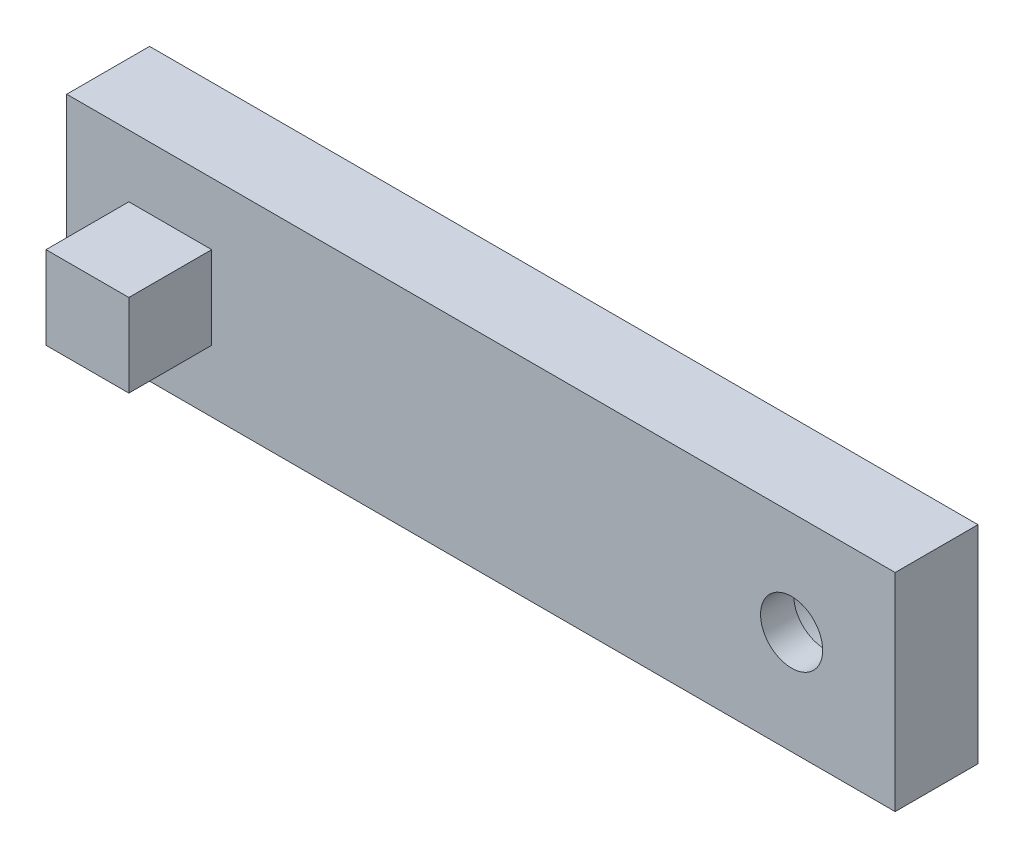
ISO-10303-21;
HEADER;
FILE_DESCRIPTION(('STEP AP214'),'2;1');
FILE_NAME('part.step','',(''),(''),'','','');
FILE_SCHEMA(('AUTOMOTIVE_DESIGN { 1 0 10303 214 1 1 1 1 }'));
ENDSEC;
DATA;
#1=APPLICATION_CONTEXT('core data for automotive mechanical design processes');
#2=APPLICATION_PROTOCOL_DEFINITION('international standard','automotive_design',2000,#1);
#3=PRODUCT_CONTEXT('',#1,'mechanical');
#4=PRODUCT('Part','Part','',(#3));
#5=PRODUCT_RELATED_PRODUCT_CATEGORY('part','',(#4));
#6=PRODUCT_DEFINITION_FORMATION('','',#4);
#7=PRODUCT_DEFINITION_CONTEXT('part definition',#1,'design');
#8=PRODUCT_DEFINITION('design','',#6,#7);
#9=PRODUCT_DEFINITION_SHAPE('','',#8);
#10=(LENGTH_UNIT() NAMED_UNIT(*) SI_UNIT(.MILLI.,.METRE.));
#11=(NAMED_UNIT(*) PLANE_ANGLE_UNIT() SI_UNIT($,.RADIAN.));
#12=(NAMED_UNIT(*) SI_UNIT($,.STERADIAN.) SOLID_ANGLE_UNIT());
#13=UNCERTAINTY_MEASURE_WITH_UNIT(LENGTH_MEASURE(1.E-05),#10,'distance_accuracy_value','');
#14=(GEOMETRIC_REPRESENTATION_CONTEXT(3) GLOBAL_UNCERTAINTY_ASSIGNED_CONTEXT((#13)) GLOBAL_UNIT_ASSIGNED_CONTEXT((#10,
#11,#12)) REPRESENTATION_CONTEXT('',''));
#15=CARTESIAN_POINT('',(0.,0.,0.));
#16=DIRECTION('',(0.,0.,1.));
#17=DIRECTION('',(1.,0.,0.));
#18=AXIS2_PLACEMENT_3D('',#15,#16,#17);
#19=CARTESIAN_POINT('',(75.,0.,0.));
#20=DIRECTION('',(0.,0.,1.));
#21=DIRECTION('',(1.,0.,0.));
#22=AXIS2_PLACEMENT_3D('',#19,#20,#21);
#23=CYLINDRICAL_SURFACE('',#22,7.50000000000001);
#24=CARTESIAN_POINT('',(75.,0.,20.));
#25=DIRECTION('',(0.,0.,1.));
#26=DIRECTION('',(1.,0.,0.));
#27=AXIS2_PLACEMENT_3D('',#24,#25,#26);
#28=CIRCLE('',#27,7.50000000000001);
#29=CARTESIAN_POINT('',(82.5,0.,20.));
#30=VERTEX_POINT('',#29);
#31=EDGE_CURVE('E304',#30,#30,#28,.T.);
#32=ORIENTED_EDGE('',*,*,#31,.T.);
#33=EDGE_LOOP('',(#32));
#34=FACE_BOUND('',#33,.T.);
#35=CARTESIAN_POINT('',(75.,0.,12.));
#36=DIRECTION('',(0.,0.,-1.));
#37=DIRECTION('',(-1.,0.,0.));
#38=AXIS2_PLACEMENT_3D('',#35,#36,#37);
#39=CIRCLE('',#38,7.50000000000001);
#40=CARTESIAN_POINT('',(67.5,0.,12.));
#41=VERTEX_POINT('',#40);
#42=EDGE_CURVE('E37',#41,#41,#39,.F.);
#43=ORIENTED_EDGE('',*,*,#42,.F.);
#44=EDGE_LOOP('',(#43));
#45=FACE_BOUND('',#44,.T.);
#46=ADVANCED_FACE('F33',(#34,#45),#23,.F.);
#47=CARTESIAN_POINT('',(0.,0.,20.));
#48=DIRECTION('',(0.,0.,-1.));
#49=DIRECTION('',(-1.,0.,0.));
#50=AXIS2_PLACEMENT_3D('',#47,#48,#49);
#51=PLANE('',#50);
#52=ORIENTED_EDGE('',*,*,#31,.F.);
#53=EDGE_LOOP('',(#52));
#54=FACE_BOUND('',#53,.T.);
#55=DIRECTION('',(0.,-1.,0.));
#56=VECTOR('',#55,1.);
#57=CARTESIAN_POINT('',(-100.,25.,20.));
#58=LINE('',#57,#56);
#59=CARTESIAN_POINT('',(-100.,25.,20.));
#60=VERTEX_POINT('',#59);
#61=CARTESIAN_POINT('',(-100.,-25.,20.));
#62=VERTEX_POINT('',#61);
#63=EDGE_CURVE('E129',#60,#62,#58,.T.);
#64=ORIENTED_EDGE('',*,*,#63,.T.);
#65=DIRECTION('',(1.,0.,0.));
#66=VECTOR('',#65,1.);
#67=CARTESIAN_POINT('',(100.,-25.,20.));
#68=LINE('',#67,#66);
#69=CARTESIAN_POINT('',(100.,-25.,20.));
#70=VERTEX_POINT('',#69);
#71=EDGE_CURVE('E132',#62,#70,#68,.T.);
#72=ORIENTED_EDGE('',*,*,#71,.T.);
#73=DIRECTION('',(0.,1.,0.));
#74=VECTOR('',#73,1.);
#75=CARTESIAN_POINT('',(100.,25.,20.));
#76=LINE('',#75,#74);
#77=CARTESIAN_POINT('',(100.,25.,20.));
#78=VERTEX_POINT('',#77);
#79=EDGE_CURVE('E135',#70,#78,#76,.T.);
#80=ORIENTED_EDGE('',*,*,#79,.T.);
#81=DIRECTION('',(-1.,0.,0.));
#82=VECTOR('',#81,1.);
#83=CARTESIAN_POINT('',(100.,25.,20.));
#84=LINE('',#83,#82);
#85=EDGE_CURVE('E137',#78,#60,#84,.T.);
#86=ORIENTED_EDGE('',*,*,#85,.T.);
#87=EDGE_LOOP('',(#64,#72,#80,#86));
#88=FACE_BOUND('',#87,.T.);
#89=DIRECTION('',(0.,-1.,0.));
#90=VECTOR('',#89,1.);
#91=CARTESIAN_POINT('',(-85.,9.99999999999998,20.));
#92=LINE('',#91,#90);
#93=CARTESIAN_POINT('',(-85.,9.99999999999998,20.));
#94=VERTEX_POINT('',#93);
#95=CARTESIAN_POINT('',(-85.,-10.,20.));
#96=VERTEX_POINT('',#95);
#97=EDGE_CURVE('E119',#94,#96,#92,.T.);
#98=ORIENTED_EDGE('',*,*,#97,.F.);
#99=DIRECTION('',(-1.,0.,0.));
#100=VECTOR('',#99,1.);
#101=CARTESIAN_POINT('',(-65.,9.99999999999999,20.));
#102=LINE('',#101,#100);
#103=CARTESIAN_POINT('',(-65.,9.99999999999999,20.));
#104=VERTEX_POINT('',#103);
#105=EDGE_CURVE('E116',#104,#94,#102,.T.);
#106=ORIENTED_EDGE('',*,*,#105,.F.);
#107=DIRECTION('',(0.,1.,0.));
#108=VECTOR('',#107,1.);
#109=CARTESIAN_POINT('',(-65.,9.99999999999999,20.));
#110=LINE('',#109,#108);
#111=CARTESIAN_POINT('',(-65.,-10.,20.));
#112=VERTEX_POINT('',#111);
#113=EDGE_CURVE('E54',#112,#104,#110,.T.);
#114=ORIENTED_EDGE('',*,*,#113,.F.);
#115=DIRECTION('',(1.,0.,0.));
#116=VECTOR('',#115,1.);
#117=CARTESIAN_POINT('',(-65.,-10.,20.));
#118=LINE('',#117,#116);
#119=EDGE_CURVE('E49',#96,#112,#118,.T.);
#120=ORIENTED_EDGE('',*,*,#119,.F.);
#121=EDGE_LOOP('',(#98,#106,#114,#120));
#122=FACE_BOUND('',#121,.T.);
#123=ADVANCED_FACE('F169',(#54,#88,#122),#51,.F.);
#124=CARTESIAN_POINT('',(-100.,25.,20.));
#125=DIRECTION('',(1.,0.,0.));
#126=DIRECTION('',(0.,0.,-1.));
#127=AXIS2_PLACEMENT_3D('',#124,#125,#126);
#128=PLANE('',#127);
#129=DIRECTION('',(0.,-1.,0.));
#130=VECTOR('',#129,1.);
#131=CARTESIAN_POINT('',(-100.,25.,0.));
#132=LINE('',#131,#130);
#133=CARTESIAN_POINT('',(-100.,25.,0.));
#134=VERTEX_POINT('',#133);
#135=CARTESIAN_POINT('',(-100.,-25.,0.));
#136=VERTEX_POINT('',#135);
#137=EDGE_CURVE('E120',#134,#136,#132,.T.);
#138=ORIENTED_EDGE('',*,*,#137,.T.);
#139=DIRECTION('',(0.,0.,-1.));
#140=VECTOR('',#139,1.);
#141=CARTESIAN_POINT('',(-100.,-25.,20.));
#142=LINE('',#141,#140);
#143=EDGE_CURVE('E11',#62,#136,#142,.T.);
#144=ORIENTED_EDGE('',*,*,#143,.F.);
#145=ORIENTED_EDGE('',*,*,#63,.F.);
#146=DIRECTION('',(0.,0.,-1.));
#147=VECTOR('',#146,1.);
#148=CARTESIAN_POINT('',(-100.,25.,20.));
#149=LINE('',#148,#147);
#150=EDGE_CURVE('E138',#60,#134,#149,.T.);
#151=ORIENTED_EDGE('',*,*,#150,.T.);
#152=EDGE_LOOP('',(#138,#144,#145,#151));
#153=FACE_BOUND('',#152,.T.);
#154=ADVANCED_FACE('F35',(#153),#128,.F.);
#155=CARTESIAN_POINT('',(100.,-25.,20.));
#156=DIRECTION('',(0.,1.,0.));
#157=DIRECTION('',(-1.,0.,0.));
#158=AXIS2_PLACEMENT_3D('',#155,#156,#157);
#159=PLANE('',#158);
#160=DIRECTION('',(1.,0.,0.));
#161=VECTOR('',#160,1.);
#162=CARTESIAN_POINT('',(100.,-25.,0.));
#163=LINE('',#162,#161);
#164=CARTESIAN_POINT('',(100.,-25.,0.));
#165=VERTEX_POINT('',#164);
#166=EDGE_CURVE('E123',#136,#165,#163,.T.);
#167=ORIENTED_EDGE('',*,*,#166,.T.);
#168=DIRECTION('',(0.,0.,-1.));
#169=VECTOR('',#168,1.);
#170=CARTESIAN_POINT('',(100.,-25.,20.));
#171=LINE('',#170,#169);
#172=EDGE_CURVE('E42',#70,#165,#171,.T.);
#173=ORIENTED_EDGE('',*,*,#172,.F.);
#174=ORIENTED_EDGE('',*,*,#71,.F.);
#175=ORIENTED_EDGE('',*,*,#143,.T.);
#176=EDGE_LOOP('',(#167,#173,#174,#175));
#177=FACE_BOUND('',#176,.T.);
#178=ADVANCED_FACE('F170',(#177),#159,.F.);
#179=CARTESIAN_POINT('',(100.,25.,20.));
#180=DIRECTION('',(-1.,0.,0.));
#181=DIRECTION('',(0.,-1.,0.));
#182=AXIS2_PLACEMENT_3D('',#179,#180,#181);
#183=PLANE('',#182);
#184=DIRECTION('',(0.,1.,0.));
#185=VECTOR('',#184,1.);
#186=CARTESIAN_POINT('',(100.,25.,0.));
#187=LINE('',#186,#185);
#188=CARTESIAN_POINT('',(100.,25.,0.));
#189=VERTEX_POINT('',#188);
#190=EDGE_CURVE('E141',#165,#189,#187,.T.);
#191=ORIENTED_EDGE('',*,*,#190,.T.);
#192=DIRECTION('',(0.,0.,-1.));
#193=VECTOR('',#192,1.);
#194=CARTESIAN_POINT('',(100.,25.,20.));
#195=LINE('',#194,#193);
#196=EDGE_CURVE('E146',#78,#189,#195,.T.);
#197=ORIENTED_EDGE('',*,*,#196,.F.);
#198=ORIENTED_EDGE('',*,*,#79,.F.);
#199=ORIENTED_EDGE('',*,*,#172,.T.);
#200=EDGE_LOOP('',(#191,#197,#198,#199));
#201=FACE_BOUND('',#200,.T.);
#202=ADVANCED_FACE('F154',(#201),#183,.F.);
#203=CARTESIAN_POINT('',(100.,25.,20.));
#204=DIRECTION('',(0.,-1.,0.));
#205=DIRECTION('',(1.,0.,0.));
#206=AXIS2_PLACEMENT_3D('',#203,#204,#205);
#207=PLANE('',#206);
#208=DIRECTION('',(-1.,0.,0.));
#209=VECTOR('',#208,1.);
#210=CARTESIAN_POINT('',(100.,25.,0.));
#211=LINE('',#210,#209);
#212=EDGE_CURVE('E133',#189,#134,#211,.T.);
#213=ORIENTED_EDGE('',*,*,#212,.T.);
#214=ORIENTED_EDGE('',*,*,#150,.F.);
#215=ORIENTED_EDGE('',*,*,#85,.F.);
#216=ORIENTED_EDGE('',*,*,#196,.T.);
#217=EDGE_LOOP('',(#213,#214,#215,#216));
#218=FACE_BOUND('',#217,.T.);
#219=ADVANCED_FACE('F163',(#218),#207,.F.);
#220=CARTESIAN_POINT('',(0.,0.,0.));
#221=DIRECTION('',(0.,0.,-1.));
#222=DIRECTION('',(-1.,0.,0.));
#223=AXIS2_PLACEMENT_3D('',#220,#221,#222);
#224=PLANE('',#223);
#225=CARTESIAN_POINT('',(75.,0.,0.));
#226=DIRECTION('',(0.,0.,-1.));
#227=DIRECTION('',(-1.,0.,0.));
#228=AXIS2_PLACEMENT_3D('',#225,#226,#227);
#229=CIRCLE('',#228,16.25);
#230=CARTESIAN_POINT('',(58.75,0.,0.));
#231=VERTEX_POINT('',#230);
#232=EDGE_CURVE('E300',#231,#231,#229,.T.);
#233=ORIENTED_EDGE('',*,*,#232,.F.);
#234=EDGE_LOOP('',(#233));
#235=FACE_BOUND('',#234,.T.);
#236=ORIENTED_EDGE('',*,*,#137,.F.);
#237=ORIENTED_EDGE('',*,*,#212,.F.);
#238=ORIENTED_EDGE('',*,*,#190,.F.);
#239=ORIENTED_EDGE('',*,*,#166,.F.);
#240=EDGE_LOOP('',(#236,#237,#238,#239));
#241=FACE_BOUND('',#240,.T.);
#242=ADVANCED_FACE('F160',(#235,#241),#224,.T.);
#243=CARTESIAN_POINT('',(-85.,9.99999999999998,40.));
#244=DIRECTION('',(1.,0.,0.));
#245=DIRECTION('',(0.,0.,-1.));
#246=AXIS2_PLACEMENT_3D('',#243,#244,#245);
#247=PLANE('',#246);
#248=ORIENTED_EDGE('',*,*,#97,.T.);
#249=DIRECTION('',(0.,0.,-1.));
#250=VECTOR('',#249,1.);
#251=CARTESIAN_POINT('',(-85.,-10.,40.));
#252=LINE('',#251,#250);
#253=CARTESIAN_POINT('',(-85.,-10.,40.));
#254=VERTEX_POINT('',#253);
#255=EDGE_CURVE('E100',#254,#96,#252,.T.);
#256=ORIENTED_EDGE('',*,*,#255,.F.);
#257=DIRECTION('',(0.,-1.,0.));
#258=VECTOR('',#257,1.);
#259=CARTESIAN_POINT('',(-85.,9.99999999999998,40.));
#260=LINE('',#259,#258);
#261=CARTESIAN_POINT('',(-85.,9.99999999999998,40.));
#262=VERTEX_POINT('',#261);
#263=EDGE_CURVE('E107',#262,#254,#260,.T.);
#264=ORIENTED_EDGE('',*,*,#263,.F.);
#265=DIRECTION('',(0.,0.,-1.));
#266=VECTOR('',#265,1.);
#267=CARTESIAN_POINT('',(-85.,9.99999999999998,40.));
#268=LINE('',#267,#266);
#269=EDGE_CURVE('E308',#262,#94,#268,.T.);
#270=ORIENTED_EDGE('',*,*,#269,.T.);
#271=EDGE_LOOP('',(#248,#256,#264,#270));
#272=FACE_BOUND('',#271,.T.);
#273=ADVANCED_FACE('F118',(#272),#247,.F.);
#274=CARTESIAN_POINT('',(-65.,-10.,40.));
#275=DIRECTION('',(0.,1.,0.));
#276=DIRECTION('',(-1.,0.,0.));
#277=AXIS2_PLACEMENT_3D('',#274,#275,#276);
#278=PLANE('',#277);
#279=ORIENTED_EDGE('',*,*,#119,.T.);
#280=DIRECTION('',(0.,0.,-1.));
#281=VECTOR('',#280,1.);
#282=CARTESIAN_POINT('',(-65.,-10.,40.));
#283=LINE('',#282,#281);
#284=CARTESIAN_POINT('',(-65.,-10.,40.));
#285=VERTEX_POINT('',#284);
#286=EDGE_CURVE('E103',#285,#112,#283,.T.);
#287=ORIENTED_EDGE('',*,*,#286,.F.);
#288=DIRECTION('',(1.,0.,0.));
#289=VECTOR('',#288,1.);
#290=CARTESIAN_POINT('',(-65.,-10.,40.));
#291=LINE('',#290,#289);
#292=EDGE_CURVE('E96',#254,#285,#291,.T.);
#293=ORIENTED_EDGE('',*,*,#292,.F.);
#294=ORIENTED_EDGE('',*,*,#255,.T.);
#295=EDGE_LOOP('',(#279,#287,#293,#294));
#296=FACE_BOUND('',#295,.T.);
#297=ADVANCED_FACE('F98',(#296),#278,.F.);
#298=CARTESIAN_POINT('',(-65.,9.99999999999999,40.));
#299=DIRECTION('',(-1.,0.,0.));
#300=DIRECTION('',(0.,0.,1.));
#301=AXIS2_PLACEMENT_3D('',#298,#299,#300);
#302=PLANE('',#301);
#303=ORIENTED_EDGE('',*,*,#113,.T.);
#304=DIRECTION('',(0.,0.,-1.));
#305=VECTOR('',#304,1.);
#306=CARTESIAN_POINT('',(-65.,9.99999999999999,40.));
#307=LINE('',#306,#305);
#308=CARTESIAN_POINT('',(-65.,9.99999999999999,40.));
#309=VERTEX_POINT('',#308);
#310=EDGE_CURVE('E125',#309,#104,#307,.T.);
#311=ORIENTED_EDGE('',*,*,#310,.F.);
#312=DIRECTION('',(0.,1.,0.));
#313=VECTOR('',#312,1.);
#314=CARTESIAN_POINT('',(-65.,9.99999999999999,40.));
#315=LINE('',#314,#313);
#316=EDGE_CURVE('E106',#285,#309,#315,.T.);
#317=ORIENTED_EDGE('',*,*,#316,.F.);
#318=ORIENTED_EDGE('',*,*,#286,.T.);
#319=EDGE_LOOP('',(#303,#311,#317,#318));
#320=FACE_BOUND('',#319,.T.);
#321=ADVANCED_FACE('F197',(#320),#302,.F.);
#322=CARTESIAN_POINT('',(-65.,9.99999999999999,40.));
#323=DIRECTION('',(0.,-1.,0.));
#324=DIRECTION('',(1.,0.,0.));
#325=AXIS2_PLACEMENT_3D('',#322,#323,#324);
#326=PLANE('',#325);
#327=ORIENTED_EDGE('',*,*,#105,.T.);
#328=ORIENTED_EDGE('',*,*,#269,.F.);
#329=DIRECTION('',(-1.,0.,0.));
#330=VECTOR('',#329,1.);
#331=CARTESIAN_POINT('',(-65.,9.99999999999999,40.));
#332=LINE('',#331,#330);
#333=EDGE_CURVE('E112',#309,#262,#332,.T.);
#334=ORIENTED_EDGE('',*,*,#333,.F.);
#335=ORIENTED_EDGE('',*,*,#310,.T.);
#336=EDGE_LOOP('',(#327,#328,#334,#335));
#337=FACE_BOUND('',#336,.T.);
#338=ADVANCED_FACE('F194',(#337),#326,.F.);
#339=CARTESIAN_POINT('',(0.,0.,40.));
#340=DIRECTION('',(0.,0.,-1.));
#341=DIRECTION('',(-1.,0.,0.));
#342=AXIS2_PLACEMENT_3D('',#339,#340,#341);
#343=PLANE('',#342);
#344=ORIENTED_EDGE('',*,*,#263,.T.);
#345=ORIENTED_EDGE('',*,*,#292,.T.);
#346=ORIENTED_EDGE('',*,*,#316,.T.);
#347=ORIENTED_EDGE('',*,*,#333,.T.);
#348=EDGE_LOOP('',(#344,#345,#346,#347));
#349=FACE_BOUND('',#348,.T.);
#350=ADVANCED_FACE('F110',(#349),#343,.F.);
#351=CARTESIAN_POINT('',(75.,0.,12.));
#352=DIRECTION('',(0.,0.,-1.));
#353=DIRECTION('',(-1.,0.,0.));
#354=AXIS2_PLACEMENT_3D('',#351,#352,#353);
#355=PLANE('',#354);
#356=CARTESIAN_POINT('',(75.,0.,12.));
#357=DIRECTION('',(0.,0.,-1.));
#358=DIRECTION('',(-1.,0.,0.));
#359=AXIS2_PLACEMENT_3D('',#356,#357,#358);
#360=CIRCLE('',#359,16.25);
#361=CARTESIAN_POINT('',(58.75,0.,12.));
#362=VERTEX_POINT('',#361);
#363=EDGE_CURVE('E297',#362,#362,#360,.T.);
#364=ORIENTED_EDGE('',*,*,#363,.T.);
#365=EDGE_LOOP('',(#364));
#366=FACE_BOUND('',#365,.T.);
#367=ORIENTED_EDGE('',*,*,#42,.T.);
#368=EDGE_LOOP('',(#367));
#369=FACE_BOUND('',#368,.T.);
#370=ADVANCED_FACE('F193',(#366,#369),#355,.T.);
#371=CARTESIAN_POINT('',(75.,0.,12.));
#372=DIRECTION('',(0.,0.,-1.));
#373=DIRECTION('',(-1.,0.,0.));
#374=AXIS2_PLACEMENT_3D('',#371,#372,#373);
#375=CYLINDRICAL_SURFACE('',#374,16.25);
#376=ORIENTED_EDGE('',*,*,#363,.F.);
#377=EDGE_LOOP('',(#376));
#378=FACE_BOUND('',#377,.T.);
#379=ORIENTED_EDGE('',*,*,#232,.T.);
#380=EDGE_LOOP('',(#379));
#381=FACE_BOUND('',#380,.T.);
#382=ADVANCED_FACE('F189',(#378,#381),#375,.F.);
#383=CLOSED_SHELL('',(#46,#123,#154,#178,#202,#219,#242,#273,#297,#321,#338,#350,#370,#382));
#384=MANIFOLD_SOLID_BREP('B2',#383);
#385=ADVANCED_BREP_SHAPE_REPRESENTATION('',(#18,#384),#14);
#386=SHAPE_DEFINITION_REPRESENTATION(#9,#385);
ENDSEC;
END-ISO-10303-21;
